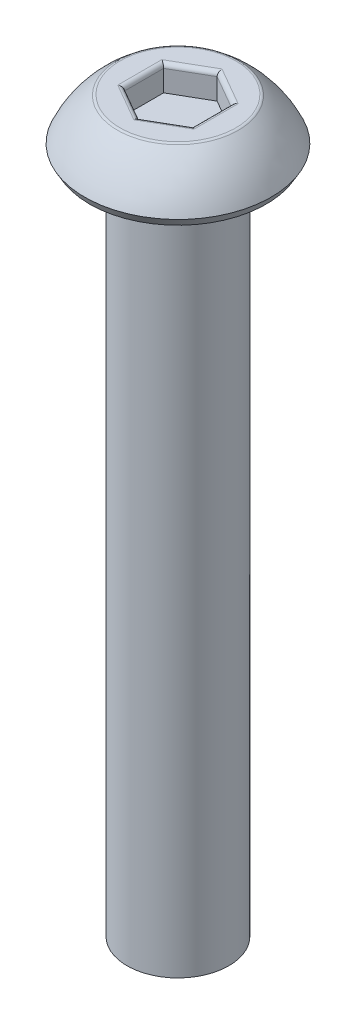
ISO-10303-21;
HEADER;
FILE_DESCRIPTION(('STEP AP214'),'2;1');
FILE_NAME('part.step','',(''),(''),'','','');
FILE_SCHEMA(('AUTOMOTIVE_DESIGN { 1 0 10303 214 1 1 1 1 }'));
ENDSEC;
DATA;
#1=APPLICATION_CONTEXT('core data for automotive mechanical design processes');
#2=APPLICATION_PROTOCOL_DEFINITION('international standard','automotive_design',2000,#1);
#3=PRODUCT_CONTEXT('',#1,'mechanical');
#4=PRODUCT('Part','Part','',(#3));
#5=PRODUCT_RELATED_PRODUCT_CATEGORY('part','',(#4));
#6=PRODUCT_DEFINITION_FORMATION('','',#4);
#7=PRODUCT_DEFINITION_CONTEXT('part definition',#1,'design');
#8=PRODUCT_DEFINITION('design','',#6,#7);
#9=PRODUCT_DEFINITION_SHAPE('','',#8);
#10=(LENGTH_UNIT() NAMED_UNIT(*) SI_UNIT(.MILLI.,.METRE.));
#11=(NAMED_UNIT(*) PLANE_ANGLE_UNIT() SI_UNIT($,.RADIAN.));
#12=(NAMED_UNIT(*) SI_UNIT($,.STERADIAN.) SOLID_ANGLE_UNIT());
#13=UNCERTAINTY_MEASURE_WITH_UNIT(LENGTH_MEASURE(1.E-05),#10,'distance_accuracy_value','');
#14=(GEOMETRIC_REPRESENTATION_CONTEXT(3) GLOBAL_UNCERTAINTY_ASSIGNED_CONTEXT((#13)) GLOBAL_UNIT_ASSIGNED_CONTEXT((#10,
#11,#12)) REPRESENTATION_CONTEXT('',''));
#15=CARTESIAN_POINT('',(0.,0.,0.));
#16=DIRECTION('',(0.,0.,1.));
#17=DIRECTION('',(1.,0.,0.));
#18=AXIS2_PLACEMENT_3D('',#15,#16,#17);
#19=CARTESIAN_POINT('',(0.,1.5,0.));
#20=DIRECTION('',(0.,-1.,0.));
#21=DIRECTION('',(0.,0.,-1.));
#22=AXIS2_PLACEMENT_3D('',#19,#20,#21);
#23=PLANE('',#22);
#24=CARTESIAN_POINT('',(0.,1.5,0.));
#25=DIRECTION('',(0.,-1.,0.));
#26=DIRECTION('',(0.,0.,-1.));
#27=AXIS2_PLACEMENT_3D('',#24,#25,#26);
#28=CIRCLE('',#27,1.70906948191647);
#29=CARTESIAN_POINT('',(0.,1.5,-1.70906948191647));
#30=VERTEX_POINT('',#29);
#31=EDGE_CURVE('E176',#30,#30,#28,.F.);
#32=ORIENTED_EDGE('',*,*,#31,.T.);
#33=EDGE_LOOP('',(#32));
#34=FACE_BOUND('',#33,.T.);
#35=DIRECTION('',(0.866025403784439,0.,-0.5));
#36=VECTOR('',#35,1.);
#37=CARTESIAN_POINT('',(0.5625,1.5,0.974278579257493));
#38=LINE('',#37,#36);
#39=CARTESIAN_POINT('',(1.125,1.5,0.649519052838329));
#40=VERTEX_POINT('',#39);
#41=CARTESIAN_POINT('',(0.,1.5,1.29903810567666));
#42=VERTEX_POINT('',#41);
#43=EDGE_CURVE('E171',#40,#42,#38,.F.);
#44=ORIENTED_EDGE('',*,*,#43,.T.);
#45=DIRECTION('',(0.866025403784439,0.,0.5));
#46=VECTOR('',#45,1.);
#47=CARTESIAN_POINT('',(-0.5625,1.5,0.974278579257493));
#48=LINE('',#47,#46);
#49=CARTESIAN_POINT('',(-1.125,1.5,0.649519052838329));
#50=VERTEX_POINT('',#49);
#51=EDGE_CURVE('E173',#42,#50,#48,.F.);
#52=ORIENTED_EDGE('',*,*,#51,.T.);
#53=DIRECTION('',(0.,0.,1.));
#54=VECTOR('',#53,1.);
#55=CARTESIAN_POINT('',(-1.125,1.5,0.));
#56=LINE('',#55,#54);
#57=CARTESIAN_POINT('',(-1.125,1.5,-0.649519052838329));
#58=VERTEX_POINT('',#57);
#59=EDGE_CURVE('E163',#50,#58,#56,.F.);
#60=ORIENTED_EDGE('',*,*,#59,.T.);
#61=DIRECTION('',(-0.866025403784439,0.,0.5));
#62=VECTOR('',#61,1.);
#63=CARTESIAN_POINT('',(-0.5625,1.5,-0.974278579257493));
#64=LINE('',#63,#62);
#65=CARTESIAN_POINT('',(0.,1.5,-1.29903810567666));
#66=VERTEX_POINT('',#65);
#67=EDGE_CURVE('E165',#58,#66,#64,.F.);
#68=ORIENTED_EDGE('',*,*,#67,.T.);
#69=DIRECTION('',(-0.866025403784439,0.,-0.5));
#70=VECTOR('',#69,1.);
#71=CARTESIAN_POINT('',(0.5625,1.5,-0.974278579257494));
#72=LINE('',#71,#70);
#73=CARTESIAN_POINT('',(1.125,1.5,-0.64951905283833));
#74=VERTEX_POINT('',#73);
#75=EDGE_CURVE('E167',#66,#74,#72,.F.);
#76=ORIENTED_EDGE('',*,*,#75,.T.);
#77=DIRECTION('',(0.,0.,-1.));
#78=VECTOR('',#77,1.);
#79=CARTESIAN_POINT('',(1.125,1.5,0.));
#80=LINE('',#79,#78);
#81=EDGE_CURVE('E169',#74,#40,#80,.F.);
#82=ORIENTED_EDGE('',*,*,#81,.T.);
#83=EDGE_LOOP('',(#44,#52,#60,#68,#76,#82));
#84=FACE_BOUND('',#83,.T.);
#85=ADVANCED_FACE('F34',(#34,#84),#23,.F.);
#86=CARTESIAN_POINT('',(0.,-0.931154789034212,0.));
#87=DIRECTION('',(0.,-1.,0.));
#88=DIRECTION('',(0.,0.,-1.));
#89=AXIS2_PLACEMENT_3D('',#86,#87,#88);
#90=DEGENERATE_TOROIDAL_SURFACE('',#89,0.00769348629276519,3.,.F.);
#91=CARTESIAN_POINT('',(0.,1.47526759952323,0.));
#92=DIRECTION('',(0.,-1.,0.));
#93=DIRECTION('',(0.,0.,-1.));
#94=AXIS2_PLACEMENT_3D('',#91,#92,#93);
#95=CIRCLE('',#94,1.78371135009948);
#96=CARTESIAN_POINT('',(0.,1.47526759952323,-1.78371135009948));
#97=VERTEX_POINT('',#96);
#98=EDGE_CURVE('E160',#97,#97,#95,.T.);
#99=ORIENTED_EDGE('',*,*,#98,.T.);
#100=EDGE_LOOP('',(#99));
#101=FACE_BOUND('',#100,.T.);
#102=CARTESIAN_POINT('',(0.,0.25,0.));
#103=DIRECTION('',(0.,-1.,0.));
#104=DIRECTION('',(0.,0.,-1.));
#105=AXIS2_PLACEMENT_3D('',#102,#103,#104);
#106=CIRCLE('',#105,2.75);
#107=CARTESIAN_POINT('',(0.,0.25,-2.75));
#108=VERTEX_POINT('',#107);
#109=EDGE_CURVE('E157',#108,#108,#106,.T.);
#110=ORIENTED_EDGE('',*,*,#109,.F.);
#111=EDGE_LOOP('',(#110));
#112=FACE_BOUND('',#111,.T.);
#113=ADVANCED_FACE('F243',(#101,#112),#90,.F.);
#114=CARTESIAN_POINT('',(0.,0.25,0.));
#115=DIRECTION('',(0.,1.,0.));
#116=DIRECTION('',(0.,0.,1.));
#117=AXIS2_PLACEMENT_3D('',#114,#115,#116);
#118=CONICAL_SURFACE('',#117,2.75,0.523598775598296);
#119=CARTESIAN_POINT('',(0.,0.,0.));
#120=DIRECTION('',(0.,-1.,0.));
#121=DIRECTION('',(0.,0.,-1.));
#122=AXIS2_PLACEMENT_3D('',#119,#120,#121);
#123=CIRCLE('',#122,2.60566243270259);
#124=CARTESIAN_POINT('',(0.,0.,-2.60566243270259));
#125=VERTEX_POINT('',#124);
#126=EDGE_CURVE('E154',#125,#125,#123,.T.);
#127=ORIENTED_EDGE('',*,*,#126,.F.);
#128=EDGE_LOOP('',(#127));
#129=FACE_BOUND('',#128,.T.);
#130=ORIENTED_EDGE('',*,*,#109,.T.);
#131=EDGE_LOOP('',(#130));
#132=FACE_BOUND('',#131,.T.);
#133=ADVANCED_FACE('F249',(#129,#132),#118,.T.);
#134=CARTESIAN_POINT('',(0.,0.,2.60566243270259));
#135=DIRECTION('',(0.,1.,0.));
#136=DIRECTION('',(0.,0.,1.));
#137=AXIS2_PLACEMENT_3D('',#134,#135,#136);
#138=PLANE('',#137);
#139=CARTESIAN_POINT('',(0.,0.,0.));
#140=DIRECTION('',(0.,-1.,0.));
#141=DIRECTION('',(0.,0.,-1.));
#142=AXIS2_PLACEMENT_3D('',#139,#140,#141);
#143=CIRCLE('',#142,1.5);
#144=CARTESIAN_POINT('',(0.,0.,-1.5));
#145=VERTEX_POINT('',#144);
#146=EDGE_CURVE('E151',#145,#145,#143,.T.);
#147=ORIENTED_EDGE('',*,*,#146,.F.);
#148=EDGE_LOOP('',(#147));
#149=FACE_BOUND('',#148,.T.);
#150=ORIENTED_EDGE('',*,*,#126,.T.);
#151=EDGE_LOOP('',(#150));
#152=FACE_BOUND('',#151,.T.);
#153=ADVANCED_FACE('F268',(#149,#152),#138,.F.);
#154=CARTESIAN_POINT('',(0.,-20.,0.));
#155=DIRECTION('',(0.,-1.,0.));
#156=DIRECTION('',(0.,0.,-1.));
#157=AXIS2_PLACEMENT_3D('',#154,#155,#156);
#158=CYLINDRICAL_SURFACE('',#157,1.5);
#159=CARTESIAN_POINT('',(0.,-20.,0.));
#160=DIRECTION('',(0.,-1.,0.));
#161=DIRECTION('',(0.,0.,-1.));
#162=AXIS2_PLACEMENT_3D('',#159,#160,#161);
#163=CIRCLE('',#162,1.5);
#164=CARTESIAN_POINT('',(0.,-20.,-1.5));
#165=VERTEX_POINT('',#164);
#166=EDGE_CURVE('E138',#165,#165,#163,.T.);
#167=ORIENTED_EDGE('',*,*,#166,.F.);
#168=EDGE_LOOP('',(#167));
#169=FACE_BOUND('',#168,.T.);
#170=ORIENTED_EDGE('',*,*,#146,.T.);
#171=EDGE_LOOP('',(#170));
#172=FACE_BOUND('',#171,.T.);
#173=ADVANCED_FACE('F273',(#169,#172),#158,.T.);
#174=CARTESIAN_POINT('',(0.,-20.,1.5));
#175=DIRECTION('',(0.,1.,0.));
#176=DIRECTION('',(0.,0.,1.));
#177=AXIS2_PLACEMENT_3D('',#174,#175,#176);
#178=PLANE('',#177);
#179=ORIENTED_EDGE('',*,*,#166,.T.);
#180=EDGE_LOOP('',(#179));
#181=FACE_BOUND('',#180,.T.);
#182=ADVANCED_FACE('F280',(#181),#178,.F.);
#183=CARTESIAN_POINT('',(0.999999999999999,0.75,-0.577350269189626));
#184=DIRECTION('',(0.5,0.,-0.866025403784439));
#185=DIRECTION('',(-0.866025403784439,0.,-0.5));
#186=AXIS2_PLACEMENT_3D('',#183,#184,#185);
#187=PLANE('',#186);
#188=DIRECTION('',(0.,1.,0.));
#189=VECTOR('',#188,1.);
#190=CARTESIAN_POINT('',(0.999999999999999,0.75,-0.577350269189626));
#191=LINE('',#190,#189);
#192=CARTESIAN_POINT('',(0.999999999999999,0.75,-0.577350269189626));
#193=VERTEX_POINT('',#192);
#194=CARTESIAN_POINT('',(0.999999999999999,1.375,-0.577350269189626));
#195=VERTEX_POINT('',#194);
#196=EDGE_CURVE('E136',#193,#195,#191,.T.);
#197=ORIENTED_EDGE('',*,*,#196,.T.);
#198=DIRECTION('',(-0.866025403784439,0.,-0.5));
#199=VECTOR('',#198,1.);
#200=CARTESIAN_POINT('',(0.999999999999999,1.375,-0.577350269189626));
#201=LINE('',#200,#199);
#202=CARTESIAN_POINT('',(0.,1.375,-1.15470053837925));
#203=VERTEX_POINT('',#202);
#204=EDGE_CURVE('E58',#195,#203,#201,.T.);
#205=ORIENTED_EDGE('',*,*,#204,.T.);
#206=DIRECTION('',(0.,1.,0.));
#207=VECTOR('',#206,1.);
#208=CARTESIAN_POINT('',(0.,0.75,-1.15470053837925));
#209=LINE('',#208,#207);
#210=CARTESIAN_POINT('',(0.,0.75,-1.15470053837925));
#211=VERTEX_POINT('',#210);
#212=EDGE_CURVE('E104',#211,#203,#209,.T.);
#213=ORIENTED_EDGE('',*,*,#212,.F.);
#214=DIRECTION('',(-0.866025403784439,0.,-0.5));
#215=VECTOR('',#214,1.);
#216=CARTESIAN_POINT('',(0.999999999999999,0.75,-0.577350269189626));
#217=LINE('',#216,#215);
#218=EDGE_CURVE('E108',#193,#211,#217,.T.);
#219=ORIENTED_EDGE('',*,*,#218,.F.);
#220=EDGE_LOOP('',(#197,#205,#213,#219));
#221=FACE_BOUND('',#220,.T.);
#222=ADVANCED_FACE('F106',(#221),#187,.F.);
#223=CARTESIAN_POINT('',(1.,0.75,0.577350269189626));
#224=DIRECTION('',(1.,0.,0.));
#225=DIRECTION('',(0.,0.,-1.));
#226=AXIS2_PLACEMENT_3D('',#223,#224,#225);
#227=PLANE('',#226);
#228=DIRECTION('',(0.,1.,0.));
#229=VECTOR('',#228,1.);
#230=CARTESIAN_POINT('',(1.,0.75,0.577350269189626));
#231=LINE('',#230,#229);
#232=CARTESIAN_POINT('',(1.,0.75,0.577350269189626));
#233=VERTEX_POINT('',#232);
#234=CARTESIAN_POINT('',(1.,1.375,0.577350269189626));
#235=VERTEX_POINT('',#234);
#236=EDGE_CURVE('E139',#233,#235,#231,.T.);
#237=ORIENTED_EDGE('',*,*,#236,.T.);
#238=DIRECTION('',(0.,0.,-1.));
#239=VECTOR('',#238,1.);
#240=CARTESIAN_POINT('',(1.,1.375,0.577350269189626));
#241=LINE('',#240,#239);
#242=EDGE_CURVE('E184',#235,#195,#241,.T.);
#243=ORIENTED_EDGE('',*,*,#242,.T.);
#244=ORIENTED_EDGE('',*,*,#196,.F.);
#245=DIRECTION('',(0.,0.,-1.));
#246=VECTOR('',#245,1.);
#247=CARTESIAN_POINT('',(1.,0.75,0.577350269189626));
#248=LINE('',#247,#246);
#249=EDGE_CURVE('E112',#233,#193,#248,.T.);
#250=ORIENTED_EDGE('',*,*,#249,.F.);
#251=EDGE_LOOP('',(#237,#243,#244,#250));
#252=FACE_BOUND('',#251,.T.);
#253=ADVANCED_FACE('F224',(#252),#227,.F.);
#254=CARTESIAN_POINT('',(0.,0.75,1.15470053837925));
#255=DIRECTION('',(0.5,0.,0.866025403784439));
#256=DIRECTION('',(0.866025403784439,0.,-0.5));
#257=AXIS2_PLACEMENT_3D('',#254,#255,#256);
#258=PLANE('',#257);
#259=DIRECTION('',(0.,1.,0.));
#260=VECTOR('',#259,1.);
#261=CARTESIAN_POINT('',(0.,0.75,1.15470053837925));
#262=LINE('',#261,#260);
#263=CARTESIAN_POINT('',(0.,0.75,1.15470053837925));
#264=VERTEX_POINT('',#263);
#265=CARTESIAN_POINT('',(0.,1.375,1.15470053837925));
#266=VERTEX_POINT('',#265);
#267=EDGE_CURVE('E142',#264,#266,#262,.T.);
#268=ORIENTED_EDGE('',*,*,#267,.T.);
#269=DIRECTION('',(0.866025403784439,0.,-0.5));
#270=VECTOR('',#269,1.);
#271=CARTESIAN_POINT('',(0.,1.375,1.15470053837925));
#272=LINE('',#271,#270);
#273=EDGE_CURVE('E182',#266,#235,#272,.T.);
#274=ORIENTED_EDGE('',*,*,#273,.T.);
#275=ORIENTED_EDGE('',*,*,#236,.F.);
#276=DIRECTION('',(0.866025403784439,0.,-0.5));
#277=VECTOR('',#276,1.);
#278=CARTESIAN_POINT('',(0.,0.75,1.15470053837925));
#279=LINE('',#278,#277);
#280=EDGE_CURVE('E133',#264,#233,#279,.T.);
#281=ORIENTED_EDGE('',*,*,#280,.F.);
#282=EDGE_LOOP('',(#268,#274,#275,#281));
#283=FACE_BOUND('',#282,.T.);
#284=ADVANCED_FACE('F225',(#283),#258,.F.);
#285=CARTESIAN_POINT('',(-0.999999999999999,0.75,0.577350269189626));
#286=DIRECTION('',(-0.5,0.,0.866025403784439));
#287=DIRECTION('',(0.866025403784439,0.,0.5));
#288=AXIS2_PLACEMENT_3D('',#285,#286,#287);
#289=PLANE('',#288);
#290=DIRECTION('',(0.,1.,0.));
#291=VECTOR('',#290,1.);
#292=CARTESIAN_POINT('',(-0.999999999999999,0.75,0.577350269189626));
#293=LINE('',#292,#291);
#294=CARTESIAN_POINT('',(-0.999999999999999,0.75,0.577350269189626));
#295=VERTEX_POINT('',#294);
#296=CARTESIAN_POINT('',(-0.999999999999999,1.375,0.577350269189626));
#297=VERTEX_POINT('',#296);
#298=EDGE_CURVE('E145',#295,#297,#293,.T.);
#299=ORIENTED_EDGE('',*,*,#298,.T.);
#300=DIRECTION('',(0.866025403784439,0.,0.5));
#301=VECTOR('',#300,1.);
#302=CARTESIAN_POINT('',(-0.999999999999999,1.375,0.577350269189626));
#303=LINE('',#302,#301);
#304=EDGE_CURVE('E179',#297,#266,#303,.T.);
#305=ORIENTED_EDGE('',*,*,#304,.T.);
#306=ORIENTED_EDGE('',*,*,#267,.F.);
#307=DIRECTION('',(0.866025403784439,0.,0.5));
#308=VECTOR('',#307,1.);
#309=CARTESIAN_POINT('',(-0.999999999999999,0.75,0.577350269189626));
#310=LINE('',#309,#308);
#311=EDGE_CURVE('E130',#295,#264,#310,.T.);
#312=ORIENTED_EDGE('',*,*,#311,.F.);
#313=EDGE_LOOP('',(#299,#305,#306,#312));
#314=FACE_BOUND('',#313,.T.);
#315=ADVANCED_FACE('F220',(#314),#289,.F.);
#316=CARTESIAN_POINT('',(-1.,0.75,-0.577350269189626));
#317=DIRECTION('',(-1.,0.,0.));
#318=DIRECTION('',(0.,0.,1.));
#319=AXIS2_PLACEMENT_3D('',#316,#317,#318);
#320=PLANE('',#319);
#321=DIRECTION('',(0.,1.,0.));
#322=VECTOR('',#321,1.);
#323=CARTESIAN_POINT('',(-1.,0.75,-0.577350269189626));
#324=LINE('',#323,#322);
#325=CARTESIAN_POINT('',(-1.,0.75,-0.577350269189626));
#326=VERTEX_POINT('',#325);
#327=CARTESIAN_POINT('',(-1.,1.375,-0.577350269189626));
#328=VERTEX_POINT('',#327);
#329=EDGE_CURVE('E111',#326,#328,#324,.T.);
#330=ORIENTED_EDGE('',*,*,#329,.T.);
#331=DIRECTION('',(0.,0.,1.));
#332=VECTOR('',#331,1.);
#333=CARTESIAN_POINT('',(-1.,1.375,-0.577350269189626));
#334=LINE('',#333,#332);
#335=EDGE_CURVE('E11',#328,#297,#334,.T.);
#336=ORIENTED_EDGE('',*,*,#335,.T.);
#337=ORIENTED_EDGE('',*,*,#298,.F.);
#338=DIRECTION('',(0.,0.,1.));
#339=VECTOR('',#338,1.);
#340=CARTESIAN_POINT('',(-1.,0.75,-0.577350269189626));
#341=LINE('',#340,#339);
#342=EDGE_CURVE('E120',#326,#295,#341,.T.);
#343=ORIENTED_EDGE('',*,*,#342,.F.);
#344=EDGE_LOOP('',(#330,#336,#337,#343));
#345=FACE_BOUND('',#344,.T.);
#346=ADVANCED_FACE('F217',(#345),#320,.F.);
#347=CARTESIAN_POINT('',(0.,0.75,-1.15470053837925));
#348=DIRECTION('',(-0.5,0.,-0.866025403784438));
#349=DIRECTION('',(-0.866025403784439,0.,0.5));
#350=AXIS2_PLACEMENT_3D('',#347,#348,#349);
#351=PLANE('',#350);
#352=ORIENTED_EDGE('',*,*,#212,.T.);
#353=DIRECTION('',(-0.866025403784439,0.,0.5));
#354=VECTOR('',#353,1.);
#355=CARTESIAN_POINT('',(0.,1.375,-1.15470053837925));
#356=LINE('',#355,#354);
#357=EDGE_CURVE('E43',#203,#328,#356,.T.);
#358=ORIENTED_EDGE('',*,*,#357,.T.);
#359=ORIENTED_EDGE('',*,*,#329,.F.);
#360=DIRECTION('',(-0.866025403784439,0.,0.5));
#361=VECTOR('',#360,1.);
#362=CARTESIAN_POINT('',(0.,0.75,-1.15470053837925));
#363=LINE('',#362,#361);
#364=EDGE_CURVE('E115',#211,#326,#363,.T.);
#365=ORIENTED_EDGE('',*,*,#364,.F.);
#366=EDGE_LOOP('',(#352,#358,#359,#365));
#367=FACE_BOUND('',#366,.T.);
#368=ADVANCED_FACE('F116',(#367),#351,.F.);
#369=CARTESIAN_POINT('',(0.,0.75,0.));
#370=DIRECTION('',(0.,1.,0.));
#371=DIRECTION('',(0.,0.,1.));
#372=AXIS2_PLACEMENT_3D('',#369,#370,#371);
#373=PLANE('',#372);
#374=ORIENTED_EDGE('',*,*,#218,.T.);
#375=ORIENTED_EDGE('',*,*,#364,.T.);
#376=ORIENTED_EDGE('',*,*,#342,.T.);
#377=ORIENTED_EDGE('',*,*,#311,.T.);
#378=ORIENTED_EDGE('',*,*,#280,.T.);
#379=ORIENTED_EDGE('',*,*,#249,.T.);
#380=EDGE_LOOP('',(#374,#375,#376,#377,#378,#379));
#381=FACE_BOUND('',#380,.T.);
#382=ADVANCED_FACE('F122',(#381),#373,.T.);
#383=CARTESIAN_POINT('',(0.,1.375,0.));
#384=DIRECTION('',(0.,-1.,0.));
#385=DIRECTION('',(0.,0.,-1.));
#386=AXIS2_PLACEMENT_3D('',#383,#384,#385);
#387=TOROIDAL_SURFACE('',#386,1.70906948191647,0.125);
#388=ORIENTED_EDGE('',*,*,#31,.F.);
#389=EDGE_LOOP('',(#388));
#390=FACE_BOUND('',#389,.T.);
#391=ORIENTED_EDGE('',*,*,#98,.F.);
#392=EDGE_LOOP('',(#391));
#393=FACE_BOUND('',#392,.T.);
#394=ADVANCED_FACE('F253',(#390,#393),#387,.T.);
#395=CARTESIAN_POINT('',(1.0625,1.375,-0.685603444662681));
#396=DIRECTION('',(-0.866025403784439,0.,-0.5));
#397=DIRECTION('',(-0.5,0.,0.866025403784439));
#398=AXIS2_PLACEMENT_3D('',#395,#396,#397);
#399=CYLINDRICAL_SURFACE('',#398,0.125);
#400=CARTESIAN_POINT('',(1.125,1.375,-0.64951905283833));
#401=DIRECTION('',(-0.5,0.,-0.866025403784438));
#402=DIRECTION('',(0.866025403784439,0.,-0.5));
#403=AXIS2_PLACEMENT_3D('',#400,#401,#402);
#404=ELLIPSE('',#403,0.144337567297406,0.125);
#405=EDGE_CURVE('E127',#74,#195,#404,.F.);
#406=ORIENTED_EDGE('',*,*,#405,.F.);
#407=ORIENTED_EDGE('',*,*,#75,.F.);
#408=CARTESIAN_POINT('',(0.,1.375,-1.29903810567666));
#409=DIRECTION('',(-1.,0.,0.));
#410=DIRECTION('',(0.,0.,-1.));
#411=AXIS2_PLACEMENT_3D('',#408,#409,#410);
#412=ELLIPSE('',#411,0.144337567297406,0.125);
#413=EDGE_CURVE('E38',#203,#66,#412,.T.);
#414=ORIENTED_EDGE('',*,*,#413,.F.);
#415=ORIENTED_EDGE('',*,*,#204,.F.);
#416=EDGE_LOOP('',(#406,#407,#414,#415));
#417=FACE_BOUND('',#416,.T.);
#418=ADVANCED_FACE('F36',(#417),#399,.T.);
#419=CARTESIAN_POINT('',(-0.0625000000000002,1.375,-1.26295371385231));
#420=DIRECTION('',(-0.866025403784439,0.,0.5));
#421=DIRECTION('',(0.5,0.,0.866025403784439));
#422=AXIS2_PLACEMENT_3D('',#419,#420,#421);
#423=CYLINDRICAL_SURFACE('',#422,0.125);
#424=ORIENTED_EDGE('',*,*,#413,.T.);
#425=ORIENTED_EDGE('',*,*,#67,.F.);
#426=CARTESIAN_POINT('',(-1.125,1.375,-0.649519052838329));
#427=DIRECTION('',(-0.5,0.,0.866025403784439));
#428=DIRECTION('',(-0.866025403784439,0.,-0.5));
#429=AXIS2_PLACEMENT_3D('',#426,#427,#428);
#430=ELLIPSE('',#429,0.144337567297406,0.125);
#431=EDGE_CURVE('E195',#328,#58,#430,.T.);
#432=ORIENTED_EDGE('',*,*,#431,.F.);
#433=ORIENTED_EDGE('',*,*,#357,.F.);
#434=EDGE_LOOP('',(#424,#425,#432,#433));
#435=FACE_BOUND('',#434,.T.);
#436=ADVANCED_FACE('F209',(#435),#423,.T.);
#437=CARTESIAN_POINT('',(1.125,1.375,0.577350269189626));
#438=DIRECTION('',(0.,0.,-1.));
#439=DIRECTION('',(-1.,0.,0.));
#440=AXIS2_PLACEMENT_3D('',#437,#438,#439);
#441=CYLINDRICAL_SURFACE('',#440,0.125);
#442=ORIENTED_EDGE('',*,*,#405,.T.);
#443=ORIENTED_EDGE('',*,*,#242,.F.);
#444=CARTESIAN_POINT('',(1.125,1.375,0.649519052838329));
#445=DIRECTION('',(0.5,0.,-0.866025403784439));
#446=DIRECTION('',(0.866025403784439,0.,0.5));
#447=AXIS2_PLACEMENT_3D('',#444,#445,#446);
#448=ELLIPSE('',#447,0.144337567297406,0.125);
#449=EDGE_CURVE('E192',#40,#235,#448,.F.);
#450=ORIENTED_EDGE('',*,*,#449,.F.);
#451=ORIENTED_EDGE('',*,*,#81,.F.);
#452=EDGE_LOOP('',(#442,#443,#450,#451));
#453=FACE_BOUND('',#452,.T.);
#454=ADVANCED_FACE('F202',(#453),#441,.T.);
#455=CARTESIAN_POINT('',(-1.125,1.375,-0.577350269189626));
#456=DIRECTION('',(0.,0.,1.));
#457=DIRECTION('',(1.,0.,0.));
#458=AXIS2_PLACEMENT_3D('',#455,#456,#457);
#459=CYLINDRICAL_SURFACE('',#458,0.125);
#460=ORIENTED_EDGE('',*,*,#431,.T.);
#461=ORIENTED_EDGE('',*,*,#59,.F.);
#462=CARTESIAN_POINT('',(-1.125,1.375,0.649519052838329));
#463=DIRECTION('',(0.5,0.,0.866025403784438));
#464=DIRECTION('',(0.866025403784439,0.,-0.5));
#465=AXIS2_PLACEMENT_3D('',#462,#463,#464);
#466=ELLIPSE('',#465,0.144337567297406,0.125);
#467=EDGE_CURVE('E190',#297,#50,#466,.T.);
#468=ORIENTED_EDGE('',*,*,#467,.F.);
#469=ORIENTED_EDGE('',*,*,#335,.F.);
#470=EDGE_LOOP('',(#460,#461,#468,#469));
#471=FACE_BOUND('',#470,.T.);
#472=ADVANCED_FACE('F214',(#471),#459,.T.);
#473=CARTESIAN_POINT('',(0.0625000000000004,1.375,1.26295371385231));
#474=DIRECTION('',(0.866025403784439,0.,-0.5));
#475=DIRECTION('',(-0.5,0.,-0.866025403784439));
#476=AXIS2_PLACEMENT_3D('',#473,#474,#475);
#477=CYLINDRICAL_SURFACE('',#476,0.125);
#478=ORIENTED_EDGE('',*,*,#449,.T.);
#479=ORIENTED_EDGE('',*,*,#273,.F.);
#480=CARTESIAN_POINT('',(0.,1.375,1.29903810567666));
#481=DIRECTION('',(1.,0.,0.));
#482=DIRECTION('',(0.,0.,1.));
#483=AXIS2_PLACEMENT_3D('',#480,#481,#482);
#484=ELLIPSE('',#483,0.144337567297406,0.125);
#485=EDGE_CURVE('E188',#42,#266,#484,.F.);
#486=ORIENTED_EDGE('',*,*,#485,.F.);
#487=ORIENTED_EDGE('',*,*,#43,.F.);
#488=EDGE_LOOP('',(#478,#479,#486,#487));
#489=FACE_BOUND('',#488,.T.);
#490=ADVANCED_FACE('F229',(#489),#477,.T.);
#491=CARTESIAN_POINT('',(-1.0625,1.375,0.685603444662681));
#492=DIRECTION('',(0.866025403784439,0.,0.5));
#493=DIRECTION('',(0.5,0.,-0.866025403784439));
#494=AXIS2_PLACEMENT_3D('',#491,#492,#493);
#495=CYLINDRICAL_SURFACE('',#494,0.125);
#496=ORIENTED_EDGE('',*,*,#467,.T.);
#497=ORIENTED_EDGE('',*,*,#51,.F.);
#498=ORIENTED_EDGE('',*,*,#485,.T.);
#499=ORIENTED_EDGE('',*,*,#304,.F.);
#500=EDGE_LOOP('',(#496,#497,#498,#499));
#501=FACE_BOUND('',#500,.T.);
#502=ADVANCED_FACE('F234',(#501),#495,.T.);
#503=CLOSED_SHELL('',(#85,#113,#133,#153,#173,#182,#222,#253,#284,#315,#346,#368,#382,#394,#418,
#436,#454,#472,#490,#502));
#504=MANIFOLD_SOLID_BREP('B2',#503);
#505=ADVANCED_BREP_SHAPE_REPRESENTATION('',(#18,#504),#14);
#506=SHAPE_DEFINITION_REPRESENTATION(#9,#505);
ENDSEC;
END-ISO-10303-21;
